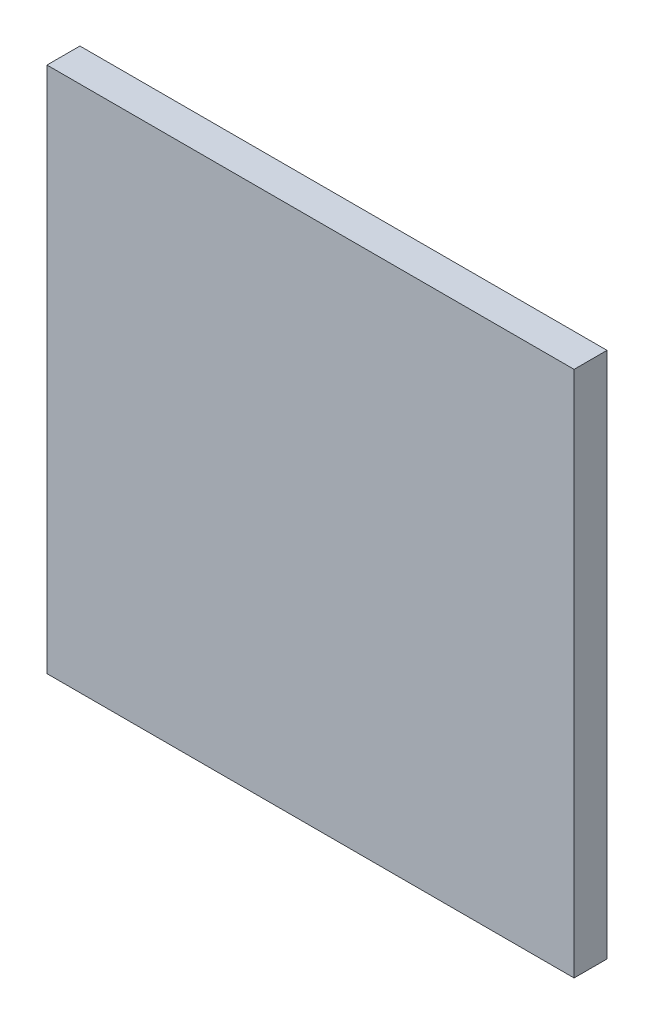
ISO-10303-21;
HEADER;
FILE_DESCRIPTION(('STEP AP214'),'2;1');
FILE_NAME('part.step','',(''),(''),'','','');
FILE_SCHEMA(('AUTOMOTIVE_DESIGN { 1 0 10303 214 1 1 1 1 }'));
ENDSEC;
DATA;
#1=APPLICATION_CONTEXT('core data for automotive mechanical design processes');
#2=APPLICATION_PROTOCOL_DEFINITION('international standard','automotive_design',2000,#1);
#3=PRODUCT_CONTEXT('',#1,'mechanical');
#4=PRODUCT('Part','Part','',(#3));
#5=PRODUCT_RELATED_PRODUCT_CATEGORY('part','',(#4));
#6=PRODUCT_DEFINITION_FORMATION('','',#4);
#7=PRODUCT_DEFINITION_CONTEXT('part definition',#1,'design');
#8=PRODUCT_DEFINITION('design','',#6,#7);
#9=PRODUCT_DEFINITION_SHAPE('','',#8);
#10=(LENGTH_UNIT() NAMED_UNIT(*) SI_UNIT(.MILLI.,.METRE.));
#11=(NAMED_UNIT(*) PLANE_ANGLE_UNIT() SI_UNIT($,.RADIAN.));
#12=(NAMED_UNIT(*) SI_UNIT($,.STERADIAN.) SOLID_ANGLE_UNIT());
#13=UNCERTAINTY_MEASURE_WITH_UNIT(LENGTH_MEASURE(1.E-05),#10,'distance_accuracy_value','');
#14=(GEOMETRIC_REPRESENTATION_CONTEXT(3) GLOBAL_UNCERTAINTY_ASSIGNED_CONTEXT((#13)) GLOBAL_UNIT_ASSIGNED_CONTEXT((#10,
#11,#12)) REPRESENTATION_CONTEXT('',''));
#15=CARTESIAN_POINT('',(0.,0.,0.));
#16=DIRECTION('',(0.,0.,1.));
#17=DIRECTION('',(1.,0.,0.));
#18=AXIS2_PLACEMENT_3D('',#15,#16,#17);
#19=CARTESIAN_POINT('',(20.,-20.,2.5));
#20=DIRECTION('',(-1.,0.,0.));
#21=DIRECTION('',(0.,0.,1.));
#22=AXIS2_PLACEMENT_3D('',#19,#20,#21);
#23=PLANE('',#22);
#24=DIRECTION('',(0.,1.,0.));
#25=VECTOR('',#24,1.);
#26=CARTESIAN_POINT('',(20.,-20.,0.));
#27=LINE('',#26,#25);
#28=CARTESIAN_POINT('',(20.,-20.,0.));
#29=VERTEX_POINT('',#28);
#30=CARTESIAN_POINT('',(20.,20.,0.));
#31=VERTEX_POINT('',#30);
#32=EDGE_CURVE('E111',#29,#31,#27,.T.);
#33=ORIENTED_EDGE('',*,*,#32,.T.);
#34=DIRECTION('',(0.,0.,-1.));
#35=VECTOR('',#34,1.);
#36=CARTESIAN_POINT('',(20.,20.,2.5));
#37=LINE('',#36,#35);
#38=CARTESIAN_POINT('',(20.,20.,2.5));
#39=VERTEX_POINT('',#38);
#40=EDGE_CURVE('E11',#39,#31,#37,.T.);
#41=ORIENTED_EDGE('',*,*,#40,.F.);
#42=DIRECTION('',(0.,1.,0.));
#43=VECTOR('',#42,1.);
#44=CARTESIAN_POINT('',(20.,-20.,2.5));
#45=LINE('',#44,#43);
#46=CARTESIAN_POINT('',(20.,-20.,2.5));
#47=VERTEX_POINT('',#46);
#48=EDGE_CURVE('E95',#47,#39,#45,.T.);
#49=ORIENTED_EDGE('',*,*,#48,.F.);
#50=DIRECTION('',(0.,0.,-1.));
#51=VECTOR('',#50,1.);
#52=CARTESIAN_POINT('',(20.,-20.,2.5));
#53=LINE('',#52,#51);
#54=EDGE_CURVE('E107',#47,#29,#53,.T.);
#55=ORIENTED_EDGE('',*,*,#54,.T.);
#56=EDGE_LOOP('',(#33,#41,#49,#55));
#57=FACE_BOUND('',#56,.T.);
#58=ADVANCED_FACE('F43',(#57),#23,.F.);
#59=CARTESIAN_POINT('',(-20.,20.,2.5));
#60=DIRECTION('',(0.,-1.,0.));
#61=DIRECTION('',(0.,0.,-1.));
#62=AXIS2_PLACEMENT_3D('',#59,#60,#61);
#63=PLANE('',#62);
#64=DIRECTION('',(-1.,0.,0.));
#65=VECTOR('',#64,1.);
#66=CARTESIAN_POINT('',(-20.,20.,0.));
#67=LINE('',#66,#65);
#68=CARTESIAN_POINT('',(-20.,20.,0.));
#69=VERTEX_POINT('',#68);
#70=EDGE_CURVE('E100',#31,#69,#67,.T.);
#71=ORIENTED_EDGE('',*,*,#70,.T.);
#72=DIRECTION('',(0.,0.,-1.));
#73=VECTOR('',#72,1.);
#74=CARTESIAN_POINT('',(-20.,20.,2.5));
#75=LINE('',#74,#73);
#76=CARTESIAN_POINT('',(-20.,20.,2.5));
#77=VERTEX_POINT('',#76);
#78=EDGE_CURVE('E52',#77,#69,#75,.T.);
#79=ORIENTED_EDGE('',*,*,#78,.F.);
#80=DIRECTION('',(-1.,0.,0.));
#81=VECTOR('',#80,1.);
#82=CARTESIAN_POINT('',(-20.,20.,2.5));
#83=LINE('',#82,#81);
#84=EDGE_CURVE('E90',#39,#77,#83,.T.);
#85=ORIENTED_EDGE('',*,*,#84,.F.);
#86=ORIENTED_EDGE('',*,*,#40,.T.);
#87=EDGE_LOOP('',(#71,#79,#85,#86));
#88=FACE_BOUND('',#87,.T.);
#89=ADVANCED_FACE('F99',(#88),#63,.F.);
#90=CARTESIAN_POINT('',(-20.,-20.,2.5));
#91=DIRECTION('',(1.,0.,0.));
#92=DIRECTION('',(0.,0.,-1.));
#93=AXIS2_PLACEMENT_3D('',#90,#91,#92);
#94=PLANE('',#93);
#95=DIRECTION('',(0.,-1.,0.));
#96=VECTOR('',#95,1.);
#97=CARTESIAN_POINT('',(-20.,-20.,0.));
#98=LINE('',#97,#96);
#99=CARTESIAN_POINT('',(-20.,-20.,0.));
#100=VERTEX_POINT('',#99);
#101=EDGE_CURVE('E77',#69,#100,#98,.T.);
#102=ORIENTED_EDGE('',*,*,#101,.T.);
#103=DIRECTION('',(0.,0.,-1.));
#104=VECTOR('',#103,1.);
#105=CARTESIAN_POINT('',(-20.,-20.,2.5));
#106=LINE('',#105,#104);
#107=CARTESIAN_POINT('',(-20.,-20.,2.5));
#108=VERTEX_POINT('',#107);
#109=EDGE_CURVE('E102',#108,#100,#106,.T.);
#110=ORIENTED_EDGE('',*,*,#109,.F.);
#111=DIRECTION('',(0.,-1.,0.));
#112=VECTOR('',#111,1.);
#113=CARTESIAN_POINT('',(-20.,-20.,2.5));
#114=LINE('',#113,#112);
#115=EDGE_CURVE('E93',#77,#108,#114,.T.);
#116=ORIENTED_EDGE('',*,*,#115,.F.);
#117=ORIENTED_EDGE('',*,*,#78,.T.);
#118=EDGE_LOOP('',(#102,#110,#116,#117));
#119=FACE_BOUND('',#118,.T.);
#120=ADVANCED_FACE('F103',(#119),#94,.F.);
#121=CARTESIAN_POINT('',(-20.,-20.,2.5));
#122=DIRECTION('',(0.,1.,0.));
#123=DIRECTION('',(0.,0.,1.));
#124=AXIS2_PLACEMENT_3D('',#121,#122,#123);
#125=PLANE('',#124);
#126=DIRECTION('',(1.,0.,0.));
#127=VECTOR('',#126,1.);
#128=CARTESIAN_POINT('',(-20.,-20.,0.));
#129=LINE('',#128,#127);
#130=EDGE_CURVE('E83',#100,#29,#129,.T.);
#131=ORIENTED_EDGE('',*,*,#130,.T.);
#132=ORIENTED_EDGE('',*,*,#54,.F.);
#133=DIRECTION('',(1.,0.,0.));
#134=VECTOR('',#133,1.);
#135=CARTESIAN_POINT('',(-20.,-20.,2.5));
#136=LINE('',#135,#134);
#137=EDGE_CURVE('E60',#108,#47,#136,.T.);
#138=ORIENTED_EDGE('',*,*,#137,.F.);
#139=ORIENTED_EDGE('',*,*,#109,.T.);
#140=EDGE_LOOP('',(#131,#132,#138,#139));
#141=FACE_BOUND('',#140,.T.);
#142=ADVANCED_FACE('F124',(#141),#125,.F.);
#143=CARTESIAN_POINT('',(0.,0.,2.5));
#144=DIRECTION('',(0.,0.,-1.));
#145=DIRECTION('',(-1.,0.,0.));
#146=AXIS2_PLACEMENT_3D('',#143,#144,#145);
#147=PLANE('',#146);
#148=ORIENTED_EDGE('',*,*,#48,.T.);
#149=ORIENTED_EDGE('',*,*,#84,.T.);
#150=ORIENTED_EDGE('',*,*,#115,.T.);
#151=ORIENTED_EDGE('',*,*,#137,.T.);
#152=EDGE_LOOP('',(#148,#149,#150,#151));
#153=FACE_BOUND('',#152,.T.);
#154=ADVANCED_FACE('F91',(#153),#147,.F.);
#155=CARTESIAN_POINT('',(0.,0.,0.));
#156=DIRECTION('',(0.,0.,-1.));
#157=DIRECTION('',(-1.,0.,0.));
#158=AXIS2_PLACEMENT_3D('',#155,#156,#157);
#159=PLANE('',#158);
#160=ORIENTED_EDGE('',*,*,#32,.F.);
#161=ORIENTED_EDGE('',*,*,#130,.F.);
#162=ORIENTED_EDGE('',*,*,#101,.F.);
#163=ORIENTED_EDGE('',*,*,#70,.F.);
#164=EDGE_LOOP('',(#160,#161,#162,#163));
#165=FACE_BOUND('',#164,.T.);
#166=ADVANCED_FACE('F127',(#165),#159,.T.);
#167=CLOSED_SHELL('',(#58,#89,#120,#142,#154,#166));
#168=MANIFOLD_SOLID_BREP('B2',#167);
#169=ADVANCED_BREP_SHAPE_REPRESENTATION('',(#18,#168),#14);
#170=SHAPE_DEFINITION_REPRESENTATION(#9,#169);
ENDSEC;
END-ISO-10303-21;
